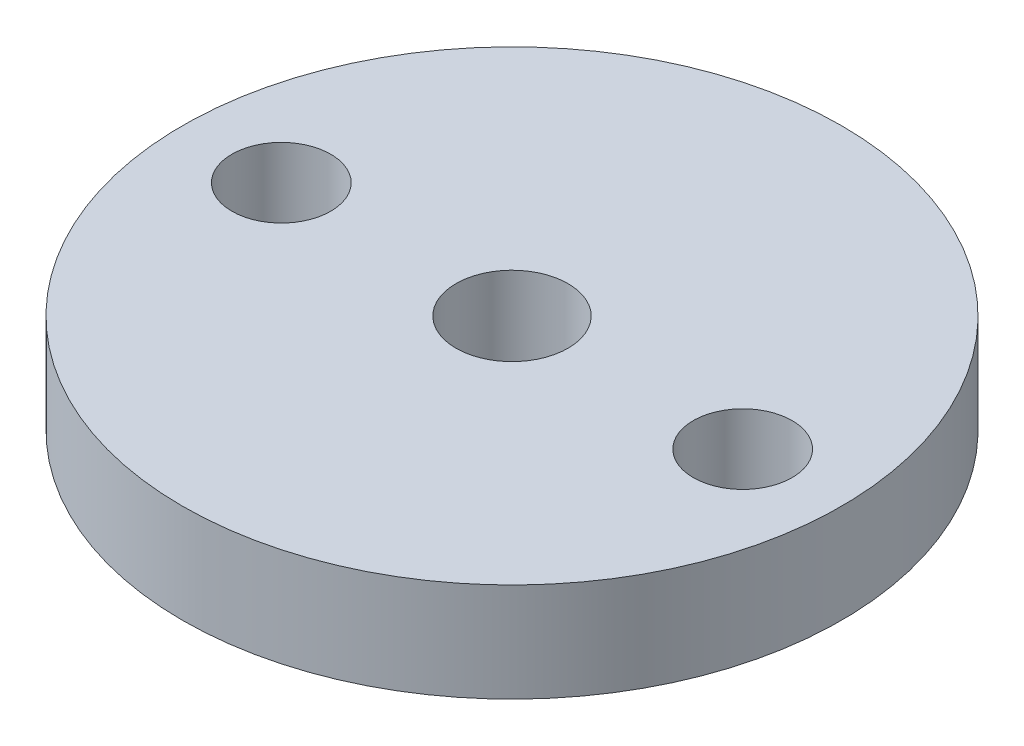
ISO-10303-21;
HEADER;
FILE_DESCRIPTION(('STEP AP214'),'2;1');
FILE_NAME('part.step','',(''),(''),'','','');
FILE_SCHEMA(('AUTOMOTIVE_DESIGN { 1 0 10303 214 1 1 1 1 }'));
ENDSEC;
DATA;
#1=APPLICATION_CONTEXT('core data for automotive mechanical design processes');
#2=APPLICATION_PROTOCOL_DEFINITION('international standard','automotive_design',2000,#1);
#3=PRODUCT_CONTEXT('',#1,'mechanical');
#4=PRODUCT('Part','Part','',(#3));
#5=PRODUCT_RELATED_PRODUCT_CATEGORY('part','',(#4));
#6=PRODUCT_DEFINITION_FORMATION('','',#4);
#7=PRODUCT_DEFINITION_CONTEXT('part definition',#1,'design');
#8=PRODUCT_DEFINITION('design','',#6,#7);
#9=PRODUCT_DEFINITION_SHAPE('','',#8);
#10=(LENGTH_UNIT() NAMED_UNIT(*) SI_UNIT(.MILLI.,.METRE.));
#11=(NAMED_UNIT(*) PLANE_ANGLE_UNIT() SI_UNIT($,.RADIAN.));
#12=(NAMED_UNIT(*) SI_UNIT($,.STERADIAN.) SOLID_ANGLE_UNIT());
#13=UNCERTAINTY_MEASURE_WITH_UNIT(LENGTH_MEASURE(1.E-05),#10,'distance_accuracy_value','');
#14=(GEOMETRIC_REPRESENTATION_CONTEXT(3) GLOBAL_UNCERTAINTY_ASSIGNED_CONTEXT((#13)) GLOBAL_UNIT_ASSIGNED_CONTEXT((#10,
#11,#12)) REPRESENTATION_CONTEXT('',''));
#15=CARTESIAN_POINT('',(0.,0.,0.));
#16=DIRECTION('',(0.,0.,1.));
#17=DIRECTION('',(1.,0.,0.));
#18=AXIS2_PLACEMENT_3D('',#15,#16,#17);
#19=CARTESIAN_POINT('',(0.,3.,0.));
#20=DIRECTION('',(0.,1.,0.));
#21=DIRECTION('',(0.,0.,1.));
#22=AXIS2_PLACEMENT_3D('',#19,#20,#21);
#23=PLANE('',#22);
#24=CARTESIAN_POINT('',(7.,3.,0.));
#25=DIRECTION('',(0.,1.,0.));
#26=DIRECTION('',(0.,0.,1.));
#27=AXIS2_PLACEMENT_3D('',#24,#25,#26);
#28=CIRCLE('',#27,1.5);
#29=CARTESIAN_POINT('',(7.,3.,1.5));
#30=VERTEX_POINT('',#29);
#31=EDGE_CURVE('E55',#30,#30,#28,.T.);
#32=ORIENTED_EDGE('',*,*,#31,.F.);
#33=EDGE_LOOP('',(#32));
#34=FACE_BOUND('',#33,.T.);
#35=CARTESIAN_POINT('',(0.,3.,0.));
#36=DIRECTION('',(0.,1.,0.));
#37=DIRECTION('',(0.,0.,1.));
#38=AXIS2_PLACEMENT_3D('',#35,#36,#37);
#39=CIRCLE('',#38,10.);
#40=CARTESIAN_POINT('',(0.,3.,10.));
#41=VERTEX_POINT('',#40);
#42=EDGE_CURVE('E10',#41,#41,#39,.T.);
#43=ORIENTED_EDGE('',*,*,#42,.T.);
#44=EDGE_LOOP('',(#43));
#45=FACE_BOUND('',#44,.T.);
#46=CARTESIAN_POINT('',(0.,3.,0.));
#47=DIRECTION('',(0.,1.,0.));
#48=DIRECTION('',(0.,0.,1.));
#49=AXIS2_PLACEMENT_3D('',#46,#47,#48);
#50=CIRCLE('',#49,1.7);
#51=CARTESIAN_POINT('',(0.,3.,1.7));
#52=VERTEX_POINT('',#51);
#53=EDGE_CURVE('E50',#52,#52,#50,.T.);
#54=ORIENTED_EDGE('',*,*,#53,.F.);
#55=EDGE_LOOP('',(#54));
#56=FACE_BOUND('',#55,.T.);
#57=CARTESIAN_POINT('',(-7.,3.,0.));
#58=DIRECTION('',(0.,1.,0.));
#59=DIRECTION('',(0.,0.,1.));
#60=AXIS2_PLACEMENT_3D('',#57,#58,#59);
#61=CIRCLE('',#60,1.5);
#62=CARTESIAN_POINT('',(-7.,3.,1.5));
#63=VERTEX_POINT('',#62);
#64=EDGE_CURVE('E61',#63,#63,#61,.T.);
#65=ORIENTED_EDGE('',*,*,#64,.F.);
#66=EDGE_LOOP('',(#65));
#67=FACE_BOUND('',#66,.T.);
#68=ADVANCED_FACE('F39',(#34,#45,#56,#67),#23,.T.);
#69=CARTESIAN_POINT('',(0.,0.,0.));
#70=DIRECTION('',(0.,1.,0.));
#71=DIRECTION('',(0.,0.,1.));
#72=AXIS2_PLACEMENT_3D('',#69,#70,#71);
#73=PLANE('',#72);
#74=CARTESIAN_POINT('',(0.,0.,0.));
#75=DIRECTION('',(0.,1.,0.));
#76=DIRECTION('',(0.,0.,1.));
#77=AXIS2_PLACEMENT_3D('',#74,#75,#76);
#78=CIRCLE('',#77,10.);
#79=CARTESIAN_POINT('',(0.,0.,10.));
#80=VERTEX_POINT('',#79);
#81=EDGE_CURVE('E43',#80,#80,#78,.T.);
#82=ORIENTED_EDGE('',*,*,#81,.F.);
#83=EDGE_LOOP('',(#82));
#84=FACE_BOUND('',#83,.T.);
#85=CARTESIAN_POINT('',(0.,0.,0.));
#86=DIRECTION('',(0.,1.,0.));
#87=DIRECTION('',(0.,0.,1.));
#88=AXIS2_PLACEMENT_3D('',#85,#86,#87);
#89=CIRCLE('',#88,1.7);
#90=CARTESIAN_POINT('',(0.,0.,1.7));
#91=VERTEX_POINT('',#90);
#92=EDGE_CURVE('E52',#91,#91,#89,.T.);
#93=ORIENTED_EDGE('',*,*,#92,.T.);
#94=EDGE_LOOP('',(#93));
#95=FACE_BOUND('',#94,.T.);
#96=CARTESIAN_POINT('',(7.,0.,0.));
#97=DIRECTION('',(0.,1.,0.));
#98=DIRECTION('',(0.,0.,1.));
#99=AXIS2_PLACEMENT_3D('',#96,#97,#98);
#100=CIRCLE('',#99,1.5);
#101=CARTESIAN_POINT('',(7.,0.,1.5));
#102=VERTEX_POINT('',#101);
#103=EDGE_CURVE('E58',#102,#102,#100,.T.);
#104=ORIENTED_EDGE('',*,*,#103,.T.);
#105=EDGE_LOOP('',(#104));
#106=FACE_BOUND('',#105,.T.);
#107=CARTESIAN_POINT('',(-7.,0.,0.));
#108=DIRECTION('',(0.,1.,0.));
#109=DIRECTION('',(0.,0.,1.));
#110=AXIS2_PLACEMENT_3D('',#107,#108,#109);
#111=CIRCLE('',#110,1.5);
#112=CARTESIAN_POINT('',(-7.,0.,1.5));
#113=VERTEX_POINT('',#112);
#114=EDGE_CURVE('E64',#113,#113,#111,.T.);
#115=ORIENTED_EDGE('',*,*,#114,.T.);
#116=EDGE_LOOP('',(#115));
#117=FACE_BOUND('',#116,.T.);
#118=ADVANCED_FACE('F74',(#84,#95,#106,#117),#73,.F.);
#119=CARTESIAN_POINT('',(0.,3.,0.));
#120=DIRECTION('',(0.,-1.,0.));
#121=DIRECTION('',(0.,0.,-1.));
#122=AXIS2_PLACEMENT_3D('',#119,#120,#121);
#123=CYLINDRICAL_SURFACE('',#122,10.);
#124=ORIENTED_EDGE('',*,*,#42,.F.);
#125=EDGE_LOOP('',(#124));
#126=FACE_BOUND('',#125,.T.);
#127=ORIENTED_EDGE('',*,*,#81,.T.);
#128=EDGE_LOOP('',(#127));
#129=FACE_BOUND('',#128,.T.);
#130=ADVANCED_FACE('F41',(#126,#129),#123,.T.);
#131=CARTESIAN_POINT('',(0.,3.,0.));
#132=DIRECTION('',(0.,-1.,0.));
#133=DIRECTION('',(0.,0.,-1.));
#134=AXIS2_PLACEMENT_3D('',#131,#132,#133);
#135=CYLINDRICAL_SURFACE('',#134,1.7);
#136=ORIENTED_EDGE('',*,*,#53,.T.);
#137=EDGE_LOOP('',(#136));
#138=FACE_BOUND('',#137,.T.);
#139=ORIENTED_EDGE('',*,*,#92,.F.);
#140=EDGE_LOOP('',(#139));
#141=FACE_BOUND('',#140,.T.);
#142=ADVANCED_FACE('F83',(#138,#141),#135,.F.);
#143=CARTESIAN_POINT('',(7.,3.,0.));
#144=DIRECTION('',(0.,-1.,0.));
#145=DIRECTION('',(0.,0.,-1.));
#146=AXIS2_PLACEMENT_3D('',#143,#144,#145);
#147=CYLINDRICAL_SURFACE('',#146,1.5);
#148=ORIENTED_EDGE('',*,*,#31,.T.);
#149=EDGE_LOOP('',(#148));
#150=FACE_BOUND('',#149,.T.);
#151=ORIENTED_EDGE('',*,*,#103,.F.);
#152=EDGE_LOOP('',(#151));
#153=FACE_BOUND('',#152,.T.);
#154=ADVANCED_FACE('F86',(#150,#153),#147,.F.);
#155=CARTESIAN_POINT('',(-7.,3.,0.));
#156=DIRECTION('',(0.,-1.,0.));
#157=DIRECTION('',(0.,0.,-1.));
#158=AXIS2_PLACEMENT_3D('',#155,#156,#157);
#159=CYLINDRICAL_SURFACE('',#158,1.5);
#160=ORIENTED_EDGE('',*,*,#64,.T.);
#161=EDGE_LOOP('',(#160));
#162=FACE_BOUND('',#161,.T.);
#163=ORIENTED_EDGE('',*,*,#114,.F.);
#164=EDGE_LOOP('',(#163));
#165=FACE_BOUND('',#164,.T.);
#166=ADVANCED_FACE('F70',(#162,#165),#159,.F.);
#167=CLOSED_SHELL('',(#68,#118,#130,#142,#154,#166));
#168=MANIFOLD_SOLID_BREP('B2',#167);
#169=ADVANCED_BREP_SHAPE_REPRESENTATION('',(#18,#168),#14);
#170=SHAPE_DEFINITION_REPRESENTATION(#9,#169);
ENDSEC;
END-ISO-10303-21;
